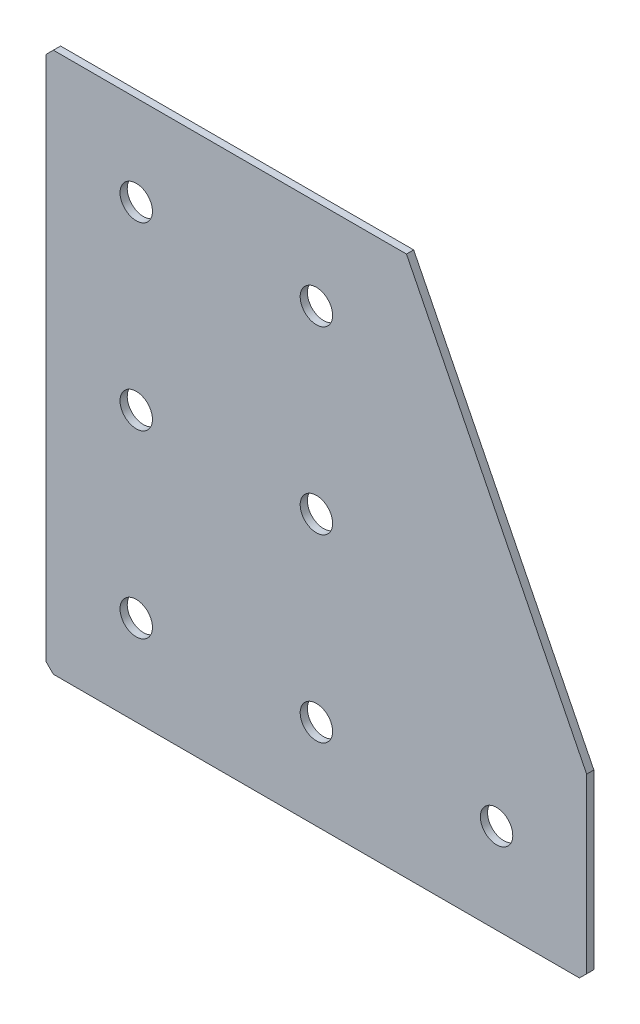
ISO-10303-21;
HEADER;
FILE_DESCRIPTION(('STEP AP214'),'2;1');
FILE_NAME('part.step','',(''),(''),'','','');
FILE_SCHEMA(('AUTOMOTIVE_DESIGN { 1 0 10303 214 1 1 1 1 }'));
ENDSEC;
DATA;
#1=APPLICATION_CONTEXT('core data for automotive mechanical design processes');
#2=APPLICATION_PROTOCOL_DEFINITION('international standard','automotive_design',2000,#1);
#3=PRODUCT_CONTEXT('',#1,'mechanical');
#4=PRODUCT('Part','Part','',(#3));
#5=PRODUCT_RELATED_PRODUCT_CATEGORY('part','',(#4));
#6=PRODUCT_DEFINITION_FORMATION('','',#4);
#7=PRODUCT_DEFINITION_CONTEXT('part definition',#1,'design');
#8=PRODUCT_DEFINITION('design','',#6,#7);
#9=PRODUCT_DEFINITION_SHAPE('','',#8);
#10=(LENGTH_UNIT() NAMED_UNIT(*) SI_UNIT(.MILLI.,.METRE.));
#11=(NAMED_UNIT(*) PLANE_ANGLE_UNIT() SI_UNIT($,.RADIAN.));
#12=(NAMED_UNIT(*) SI_UNIT($,.STERADIAN.) SOLID_ANGLE_UNIT());
#13=UNCERTAINTY_MEASURE_WITH_UNIT(LENGTH_MEASURE(1.E-05),#10,'distance_accuracy_value','');
#14=(GEOMETRIC_REPRESENTATION_CONTEXT(3) GLOBAL_UNCERTAINTY_ASSIGNED_CONTEXT((#13)) GLOBAL_UNIT_ASSIGNED_CONTEXT((#10,
#11,#12)) REPRESENTATION_CONTEXT('',''));
#15=CARTESIAN_POINT('',(0.,0.,0.));
#16=DIRECTION('',(0.,0.,1.));
#17=DIRECTION('',(1.,0.,0.));
#18=AXIS2_PLACEMENT_3D('',#15,#16,#17);
#19=CARTESIAN_POINT('',(100.,0.,-2.));
#20=DIRECTION('',(0.,-1.,0.));
#21=DIRECTION('',(1.,0.,0.));
#22=AXIS2_PLACEMENT_3D('',#19,#20,#21);
#23=PLANE('',#22);
#24=DIRECTION('',(1.,0.,0.));
#25=VECTOR('',#24,1.);
#26=CARTESIAN_POINT('',(100.,0.,-2.));
#27=LINE('',#26,#25);
#28=CARTESIAN_POINT('',(2.,0.,-2.));
#29=VERTEX_POINT('',#28);
#30=CARTESIAN_POINT('',(100.,0.,-2.));
#31=VERTEX_POINT('',#30);
#32=EDGE_CURVE('E104',#29,#31,#27,.T.);
#33=ORIENTED_EDGE('',*,*,#32,.F.);
#34=DIRECTION('',(0.,0.,1.));
#35=VECTOR('',#34,1.);
#36=CARTESIAN_POINT('',(2.,0.,-2.));
#37=LINE('',#36,#35);
#38=CARTESIAN_POINT('',(2.,0.,0.));
#39=VERTEX_POINT('',#38);
#40=EDGE_CURVE('E133',#29,#39,#37,.T.);
#41=ORIENTED_EDGE('',*,*,#40,.T.);
#42=DIRECTION('',(1.,0.,0.));
#43=VECTOR('',#42,1.);
#44=CARTESIAN_POINT('',(100.,0.,0.));
#45=LINE('',#44,#43);
#46=CARTESIAN_POINT('',(100.,0.,0.));
#47=VERTEX_POINT('',#46);
#48=EDGE_CURVE('E130',#39,#47,#45,.T.);
#49=ORIENTED_EDGE('',*,*,#48,.T.);
#50=DIRECTION('',(0.,0.,1.));
#51=VECTOR('',#50,1.);
#52=CARTESIAN_POINT('',(100.,0.,-2.));
#53=LINE('',#52,#51);
#54=EDGE_CURVE('E122',#31,#47,#53,.T.);
#55=ORIENTED_EDGE('',*,*,#54,.F.);
#56=EDGE_LOOP('',(#33,#41,#49,#55));
#57=FACE_BOUND('',#56,.T.);
#58=ADVANCED_FACE('F39',(#57),#23,.F.);
#59=CARTESIAN_POINT('',(150.,-100.,-2.));
#60=DIRECTION('',(-0.894427190999916,-0.447213595499958,0.));
#61=DIRECTION('',(0.447213595499958,-0.894427190999916,0.));
#62=AXIS2_PLACEMENT_3D('',#59,#60,#61);
#63=PLANE('',#62);
#64=DIRECTION('',(0.447213595499958,-0.894427190999916,0.));
#65=VECTOR('',#64,1.);
#66=CARTESIAN_POINT('',(150.,-100.,0.));
#67=LINE('',#66,#65);
#68=CARTESIAN_POINT('',(150.,-100.,0.));
#69=VERTEX_POINT('',#68);
#70=EDGE_CURVE('E185',#47,#69,#67,.T.);
#71=ORIENTED_EDGE('',*,*,#70,.T.);
#72=DIRECTION('',(0.,0.,1.));
#73=VECTOR('',#72,1.);
#74=CARTESIAN_POINT('',(150.,-100.,-2.));
#75=LINE('',#74,#73);
#76=CARTESIAN_POINT('',(150.,-100.,-2.));
#77=VERTEX_POINT('',#76);
#78=EDGE_CURVE('E124',#77,#69,#75,.T.);
#79=ORIENTED_EDGE('',*,*,#78,.F.);
#80=DIRECTION('',(0.447213595499958,-0.894427190999916,0.));
#81=VECTOR('',#80,1.);
#82=CARTESIAN_POINT('',(150.,-100.,-2.));
#83=LINE('',#82,#81);
#84=EDGE_CURVE('E108',#31,#77,#83,.T.);
#85=ORIENTED_EDGE('',*,*,#84,.F.);
#86=ORIENTED_EDGE('',*,*,#54,.T.);
#87=EDGE_LOOP('',(#71,#79,#85,#86));
#88=FACE_BOUND('',#87,.T.);
#89=ADVANCED_FACE('F121',(#88),#63,.F.);
#90=CARTESIAN_POINT('',(150.,-150.,-2.));
#91=DIRECTION('',(-1.,0.,0.));
#92=DIRECTION('',(0.,-1.,0.));
#93=AXIS2_PLACEMENT_3D('',#90,#91,#92);
#94=PLANE('',#93);
#95=DIRECTION('',(0.,-1.,0.));
#96=VECTOR('',#95,1.);
#97=CARTESIAN_POINT('',(150.,-150.,0.));
#98=LINE('',#97,#96);
#99=CARTESIAN_POINT('',(150.,-148.,0.));
#100=VERTEX_POINT('',#99);
#101=EDGE_CURVE('E180',#69,#100,#98,.T.);
#102=ORIENTED_EDGE('',*,*,#101,.T.);
#103=DIRECTION('',(0.,0.,-1.));
#104=VECTOR('',#103,1.);
#105=CARTESIAN_POINT('',(150.,-148.,-2.));
#106=LINE('',#105,#104);
#107=CARTESIAN_POINT('',(150.,-148.,-2.));
#108=VERTEX_POINT('',#107);
#109=EDGE_CURVE('E11',#100,#108,#106,.T.);
#110=ORIENTED_EDGE('',*,*,#109,.T.);
#111=DIRECTION('',(0.,-1.,0.));
#112=VECTOR('',#111,1.);
#113=CARTESIAN_POINT('',(150.,-150.,-2.));
#114=LINE('',#113,#112);
#115=EDGE_CURVE('E127',#77,#108,#114,.T.);
#116=ORIENTED_EDGE('',*,*,#115,.F.);
#117=ORIENTED_EDGE('',*,*,#78,.T.);
#118=EDGE_LOOP('',(#102,#110,#116,#117));
#119=FACE_BOUND('',#118,.T.);
#120=ADVANCED_FACE('F293',(#119),#94,.F.);
#121=CARTESIAN_POINT('',(0.,-150.,-2.));
#122=DIRECTION('',(0.,1.,0.));
#123=DIRECTION('',(0.,0.,1.));
#124=AXIS2_PLACEMENT_3D('',#121,#122,#123);
#125=PLANE('',#124);
#126=DIRECTION('',(-1.,0.,0.));
#127=VECTOR('',#126,1.);
#128=CARTESIAN_POINT('',(0.,-150.,-2.));
#129=LINE('',#128,#127);
#130=CARTESIAN_POINT('',(148.,-150.,-2.));
#131=VERTEX_POINT('',#130);
#132=CARTESIAN_POINT('',(2.,-150.,-2.));
#133=VERTEX_POINT('',#132);
#134=EDGE_CURVE('E172',#131,#133,#129,.T.);
#135=ORIENTED_EDGE('',*,*,#134,.F.);
#136=DIRECTION('',(0.,0.,1.));
#137=VECTOR('',#136,1.);
#138=CARTESIAN_POINT('',(148.,-150.,-2.));
#139=LINE('',#138,#137);
#140=CARTESIAN_POINT('',(148.,-150.,0.));
#141=VERTEX_POINT('',#140);
#142=EDGE_CURVE('E48',#131,#141,#139,.T.);
#143=ORIENTED_EDGE('',*,*,#142,.T.);
#144=DIRECTION('',(-1.,0.,0.));
#145=VECTOR('',#144,1.);
#146=CARTESIAN_POINT('',(0.,-150.,0.));
#147=LINE('',#146,#145);
#148=CARTESIAN_POINT('',(2.,-150.,0.));
#149=VERTEX_POINT('',#148);
#150=EDGE_CURVE('E171',#141,#149,#147,.T.);
#151=ORIENTED_EDGE('',*,*,#150,.T.);
#152=DIRECTION('',(0.,0.,-1.));
#153=VECTOR('',#152,1.);
#154=CARTESIAN_POINT('',(2.,-150.,-2.));
#155=LINE('',#154,#153);
#156=EDGE_CURVE('E55',#149,#133,#155,.T.);
#157=ORIENTED_EDGE('',*,*,#156,.T.);
#158=EDGE_LOOP('',(#135,#143,#151,#157));
#159=FACE_BOUND('',#158,.T.);
#160=ADVANCED_FACE('F170',(#159),#125,.F.);
#161=CARTESIAN_POINT('',(0.,0.,-2.));
#162=DIRECTION('',(1.,0.,0.));
#163=DIRECTION('',(0.,0.,-1.));
#164=AXIS2_PLACEMENT_3D('',#161,#162,#163);
#165=PLANE('',#164);
#166=DIRECTION('',(0.,1.,0.));
#167=VECTOR('',#166,1.);
#168=CARTESIAN_POINT('',(0.,0.,0.));
#169=LINE('',#168,#167);
#170=CARTESIAN_POINT('',(0.,-148.,0.));
#171=VERTEX_POINT('',#170);
#172=CARTESIAN_POINT('',(0.,-2.00000000000003,0.));
#173=VERTEX_POINT('',#172);
#174=EDGE_CURVE('E117',#171,#173,#169,.T.);
#175=ORIENTED_EDGE('',*,*,#174,.T.);
#176=DIRECTION('',(0.,0.,-1.));
#177=VECTOR('',#176,1.);
#178=CARTESIAN_POINT('',(0.,-2.00000000000003,-2.));
#179=LINE('',#178,#177);
#180=CARTESIAN_POINT('',(0.,-2.00000000000003,-2.));
#181=VERTEX_POINT('',#180);
#182=EDGE_CURVE('E155',#173,#181,#179,.T.);
#183=ORIENTED_EDGE('',*,*,#182,.T.);
#184=DIRECTION('',(0.,1.,0.));
#185=VECTOR('',#184,1.);
#186=CARTESIAN_POINT('',(0.,0.,-2.));
#187=LINE('',#186,#185);
#188=CARTESIAN_POINT('',(0.,-148.,-2.));
#189=VERTEX_POINT('',#188);
#190=EDGE_CURVE('E139',#189,#181,#187,.T.);
#191=ORIENTED_EDGE('',*,*,#190,.F.);
#192=DIRECTION('',(0.,0.,1.));
#193=VECTOR('',#192,1.);
#194=CARTESIAN_POINT('',(0.,-148.,-2.));
#195=LINE('',#194,#193);
#196=EDGE_CURVE('E151',#189,#171,#195,.T.);
#197=ORIENTED_EDGE('',*,*,#196,.T.);
#198=EDGE_LOOP('',(#175,#183,#191,#197));
#199=FACE_BOUND('',#198,.T.);
#200=ADVANCED_FACE('F259',(#199),#165,.F.);
#201=CARTESIAN_POINT('',(0.,0.,-2.));
#202=DIRECTION('',(0.,0.,1.));
#203=DIRECTION('',(1.,0.,0.));
#204=AXIS2_PLACEMENT_3D('',#201,#202,#203);
#205=PLANE('',#204);
#206=CARTESIAN_POINT('',(75.,-125.,-2.00000000000001));
#207=DIRECTION('',(0.,0.,-1.));
#208=DIRECTION('',(0.,1.,0.));
#209=AXIS2_PLACEMENT_3D('',#206,#207,#208);
#210=CIRCLE('',#209,4.5);
#211=CARTESIAN_POINT('',(75.,-120.5,-2.00000000000001));
#212=VERTEX_POINT('',#211);
#213=EDGE_CURVE('E250',#212,#212,#210,.T.);
#214=ORIENTED_EDGE('',*,*,#213,.F.);
#215=EDGE_LOOP('',(#214));
#216=FACE_BOUND('',#215,.T.);
#217=CARTESIAN_POINT('',(25.,-125.,-2.00000000000001));
#218=DIRECTION('',(0.,0.,-1.));
#219=DIRECTION('',(0.,1.,0.));
#220=AXIS2_PLACEMENT_3D('',#217,#218,#219);
#221=CIRCLE('',#220,4.5);
#222=CARTESIAN_POINT('',(25.,-120.5,-2.00000000000001));
#223=VERTEX_POINT('',#222);
#224=EDGE_CURVE('E242',#223,#223,#221,.T.);
#225=ORIENTED_EDGE('',*,*,#224,.F.);
#226=EDGE_LOOP('',(#225));
#227=FACE_BOUND('',#226,.T.);
#228=CARTESIAN_POINT('',(25.,-75.,-2.));
#229=DIRECTION('',(0.,0.,-1.));
#230=DIRECTION('',(0.,1.,0.));
#231=AXIS2_PLACEMENT_3D('',#228,#229,#230);
#232=CIRCLE('',#231,4.5);
#233=CARTESIAN_POINT('',(25.,-70.5,-2.));
#234=VERTEX_POINT('',#233);
#235=EDGE_CURVE('E234',#234,#234,#232,.T.);
#236=ORIENTED_EDGE('',*,*,#235,.F.);
#237=EDGE_LOOP('',(#236));
#238=FACE_BOUND('',#237,.T.);
#239=CARTESIAN_POINT('',(25.,-25.,-2.));
#240=DIRECTION('',(0.,0.,-1.));
#241=DIRECTION('',(0.,1.,0.));
#242=AXIS2_PLACEMENT_3D('',#239,#240,#241);
#243=CIRCLE('',#242,4.5);
#244=CARTESIAN_POINT('',(25.,-20.5,-2.));
#245=VERTEX_POINT('',#244);
#246=EDGE_CURVE('E226',#245,#245,#243,.T.);
#247=ORIENTED_EDGE('',*,*,#246,.F.);
#248=EDGE_LOOP('',(#247));
#249=FACE_BOUND('',#248,.T.);
#250=CARTESIAN_POINT('',(125.,-125.,-2.00000000000001));
#251=DIRECTION('',(0.,0.,-1.));
#252=DIRECTION('',(0.,1.,0.));
#253=AXIS2_PLACEMENT_3D('',#250,#251,#252);
#254=CIRCLE('',#253,4.5);
#255=CARTESIAN_POINT('',(125.,-120.5,-2.00000000000001));
#256=VERTEX_POINT('',#255);
#257=EDGE_CURVE('E218',#256,#256,#254,.T.);
#258=ORIENTED_EDGE('',*,*,#257,.F.);
#259=EDGE_LOOP('',(#258));
#260=FACE_BOUND('',#259,.T.);
#261=CARTESIAN_POINT('',(75.,-75.,-2.));
#262=DIRECTION('',(0.,0.,-1.));
#263=DIRECTION('',(0.,1.,0.));
#264=AXIS2_PLACEMENT_3D('',#261,#262,#263);
#265=CIRCLE('',#264,4.5);
#266=CARTESIAN_POINT('',(75.,-70.5,-2.));
#267=VERTEX_POINT('',#266);
#268=EDGE_CURVE('E210',#267,#267,#265,.T.);
#269=ORIENTED_EDGE('',*,*,#268,.F.);
#270=EDGE_LOOP('',(#269));
#271=FACE_BOUND('',#270,.T.);
#272=CARTESIAN_POINT('',(75.,-25.,-2.));
#273=DIRECTION('',(0.,0.,-1.));
#274=DIRECTION('',(0.,1.,0.));
#275=AXIS2_PLACEMENT_3D('',#272,#273,#274);
#276=CIRCLE('',#275,4.5);
#277=CARTESIAN_POINT('',(75.,-20.5,-2.));
#278=VERTEX_POINT('',#277);
#279=EDGE_CURVE('E202',#278,#278,#276,.T.);
#280=ORIENTED_EDGE('',*,*,#279,.F.);
#281=EDGE_LOOP('',(#280));
#282=FACE_BOUND('',#281,.T.);
#283=ORIENTED_EDGE('',*,*,#190,.T.);
#284=DIRECTION('',(-0.707106781186543,-0.707106781186552,0.));
#285=VECTOR('',#284,1.);
#286=CARTESIAN_POINT('',(2.,0.,-2.));
#287=LINE('',#286,#285);
#288=EDGE_CURVE('E111',#181,#29,#287,.F.);
#289=ORIENTED_EDGE('',*,*,#288,.T.);
#290=ORIENTED_EDGE('',*,*,#32,.T.);
#291=ORIENTED_EDGE('',*,*,#84,.T.);
#292=ORIENTED_EDGE('',*,*,#115,.T.);
#293=DIRECTION('',(0.707106781186548,0.707106781186548,0.));
#294=VECTOR('',#293,1.);
#295=CARTESIAN_POINT('',(148.,-150.,-2.));
#296=LINE('',#295,#294);
#297=EDGE_CURVE('E62',#108,#131,#296,.F.);
#298=ORIENTED_EDGE('',*,*,#297,.T.);
#299=ORIENTED_EDGE('',*,*,#134,.T.);
#300=DIRECTION('',(0.707106781186548,-0.707106781186548,0.));
#301=VECTOR('',#300,1.);
#302=CARTESIAN_POINT('',(0.,-148.,-2.));
#303=LINE('',#302,#301);
#304=EDGE_CURVE('E158',#133,#189,#303,.F.);
#305=ORIENTED_EDGE('',*,*,#304,.T.);
#306=EDGE_LOOP('',(#283,#289,#290,#291,#292,#298,#299,#305));
#307=FACE_BOUND('',#306,.T.);
#308=ADVANCED_FACE('F107',(#216,#227,#238,#249,#260,#271,#282,#307),#205,.F.);
#309=CARTESIAN_POINT('',(0.,0.,0.));
#310=DIRECTION('',(0.,0.,1.));
#311=DIRECTION('',(1.,0.,0.));
#312=AXIS2_PLACEMENT_3D('',#309,#310,#311);
#313=PLANE('',#312);
#314=CARTESIAN_POINT('',(75.,-125.,0.));
#315=DIRECTION('',(0.,0.,-1.));
#316=DIRECTION('',(0.,1.,0.));
#317=AXIS2_PLACEMENT_3D('',#314,#315,#316);
#318=CIRCLE('',#317,4.5);
#319=CARTESIAN_POINT('',(75.,-120.5,0.));
#320=VERTEX_POINT('',#319);
#321=EDGE_CURVE('E246',#320,#320,#318,.T.);
#322=ORIENTED_EDGE('',*,*,#321,.T.);
#323=EDGE_LOOP('',(#322));
#324=FACE_BOUND('',#323,.T.);
#325=CARTESIAN_POINT('',(25.,-125.,0.));
#326=DIRECTION('',(0.,0.,-1.));
#327=DIRECTION('',(0.,1.,0.));
#328=AXIS2_PLACEMENT_3D('',#325,#326,#327);
#329=CIRCLE('',#328,4.5);
#330=CARTESIAN_POINT('',(25.,-120.5,0.));
#331=VERTEX_POINT('',#330);
#332=EDGE_CURVE('E238',#331,#331,#329,.T.);
#333=ORIENTED_EDGE('',*,*,#332,.T.);
#334=EDGE_LOOP('',(#333));
#335=FACE_BOUND('',#334,.T.);
#336=CARTESIAN_POINT('',(25.,-75.,0.));
#337=DIRECTION('',(0.,0.,-1.));
#338=DIRECTION('',(0.,1.,0.));
#339=AXIS2_PLACEMENT_3D('',#336,#337,#338);
#340=CIRCLE('',#339,4.5);
#341=CARTESIAN_POINT('',(25.,-70.5,0.));
#342=VERTEX_POINT('',#341);
#343=EDGE_CURVE('E230',#342,#342,#340,.T.);
#344=ORIENTED_EDGE('',*,*,#343,.T.);
#345=EDGE_LOOP('',(#344));
#346=FACE_BOUND('',#345,.T.);
#347=CARTESIAN_POINT('',(25.,-25.,0.));
#348=DIRECTION('',(0.,0.,-1.));
#349=DIRECTION('',(0.,1.,0.));
#350=AXIS2_PLACEMENT_3D('',#347,#348,#349);
#351=CIRCLE('',#350,4.5);
#352=CARTESIAN_POINT('',(25.,-20.5,0.));
#353=VERTEX_POINT('',#352);
#354=EDGE_CURVE('E222',#353,#353,#351,.T.);
#355=ORIENTED_EDGE('',*,*,#354,.T.);
#356=EDGE_LOOP('',(#355));
#357=FACE_BOUND('',#356,.T.);
#358=CARTESIAN_POINT('',(125.,-125.,0.));
#359=DIRECTION('',(0.,0.,-1.));
#360=DIRECTION('',(0.,1.,0.));
#361=AXIS2_PLACEMENT_3D('',#358,#359,#360);
#362=CIRCLE('',#361,4.5);
#363=CARTESIAN_POINT('',(125.,-120.5,0.));
#364=VERTEX_POINT('',#363);
#365=EDGE_CURVE('E214',#364,#364,#362,.T.);
#366=ORIENTED_EDGE('',*,*,#365,.T.);
#367=EDGE_LOOP('',(#366));
#368=FACE_BOUND('',#367,.T.);
#369=CARTESIAN_POINT('',(75.,-75.,0.));
#370=DIRECTION('',(0.,0.,-1.));
#371=DIRECTION('',(0.,1.,0.));
#372=AXIS2_PLACEMENT_3D('',#369,#370,#371);
#373=CIRCLE('',#372,4.5);
#374=CARTESIAN_POINT('',(75.,-70.5,0.));
#375=VERTEX_POINT('',#374);
#376=EDGE_CURVE('E206',#375,#375,#373,.T.);
#377=ORIENTED_EDGE('',*,*,#376,.T.);
#378=EDGE_LOOP('',(#377));
#379=FACE_BOUND('',#378,.T.);
#380=CARTESIAN_POINT('',(75.,-25.,0.));
#381=DIRECTION('',(0.,0.,-1.));
#382=DIRECTION('',(0.,1.,0.));
#383=AXIS2_PLACEMENT_3D('',#380,#381,#382);
#384=CIRCLE('',#383,4.5);
#385=CARTESIAN_POINT('',(75.,-20.5,0.));
#386=VERTEX_POINT('',#385);
#387=EDGE_CURVE('E192',#386,#386,#384,.T.);
#388=ORIENTED_EDGE('',*,*,#387,.T.);
#389=EDGE_LOOP('',(#388));
#390=FACE_BOUND('',#389,.T.);
#391=ORIENTED_EDGE('',*,*,#48,.F.);
#392=DIRECTION('',(0.707106781186543,0.707106781186552,0.));
#393=VECTOR('',#392,1.);
#394=CARTESIAN_POINT('',(1.00000000000001,-1.,0.));
#395=LINE('',#394,#393);
#396=EDGE_CURVE('E148',#39,#173,#395,.F.);
#397=ORIENTED_EDGE('',*,*,#396,.T.);
#398=ORIENTED_EDGE('',*,*,#174,.F.);
#399=DIRECTION('',(-0.707106781186548,0.707106781186548,0.));
#400=VECTOR('',#399,1.);
#401=CARTESIAN_POINT('',(-74.,-74.,0.));
#402=LINE('',#401,#400);
#403=EDGE_CURVE('E137',#171,#149,#402,.F.);
#404=ORIENTED_EDGE('',*,*,#403,.T.);
#405=ORIENTED_EDGE('',*,*,#150,.F.);
#406=DIRECTION('',(-0.707106781186548,-0.707106781186548,0.));
#407=VECTOR('',#406,1.);
#408=CARTESIAN_POINT('',(149.,-149.,0.));
#409=LINE('',#408,#407);
#410=EDGE_CURVE('E145',#141,#100,#409,.F.);
#411=ORIENTED_EDGE('',*,*,#410,.T.);
#412=ORIENTED_EDGE('',*,*,#101,.F.);
#413=ORIENTED_EDGE('',*,*,#70,.F.);
#414=EDGE_LOOP('',(#391,#397,#398,#404,#405,#411,#412,#413));
#415=FACE_BOUND('',#414,.T.);
#416=ADVANCED_FACE('F175',(#324,#335,#346,#357,#368,#379,#390,#415),#313,.T.);
#417=CARTESIAN_POINT('',(75.,-25.,-2.));
#418=DIRECTION('',(0.,0.,-1.));
#419=DIRECTION('',(0.,1.,0.));
#420=AXIS2_PLACEMENT_3D('',#417,#418,#419);
#421=CYLINDRICAL_SURFACE('',#420,4.5);
#422=ORIENTED_EDGE('',*,*,#387,.F.);
#423=EDGE_LOOP('',(#422));
#424=FACE_BOUND('',#423,.T.);
#425=ORIENTED_EDGE('',*,*,#279,.T.);
#426=EDGE_LOOP('',(#425));
#427=FACE_BOUND('',#426,.T.);
#428=ADVANCED_FACE('F273',(#424,#427),#421,.F.);
#429=CARTESIAN_POINT('',(75.,-75.,-2.));
#430=DIRECTION('',(0.,0.,-1.));
#431=DIRECTION('',(0.,1.,0.));
#432=AXIS2_PLACEMENT_3D('',#429,#430,#431);
#433=CYLINDRICAL_SURFACE('',#432,4.5);
#434=ORIENTED_EDGE('',*,*,#376,.F.);
#435=EDGE_LOOP('',(#434));
#436=FACE_BOUND('',#435,.T.);
#437=ORIENTED_EDGE('',*,*,#268,.T.);
#438=EDGE_LOOP('',(#437));
#439=FACE_BOUND('',#438,.T.);
#440=ADVANCED_FACE('F275',(#436,#439),#433,.F.);
#441=CARTESIAN_POINT('',(125.,-125.,-2.00000000000001));
#442=DIRECTION('',(0.,0.,-1.));
#443=DIRECTION('',(0.,1.,0.));
#444=AXIS2_PLACEMENT_3D('',#441,#442,#443);
#445=CYLINDRICAL_SURFACE('',#444,4.5);
#446=ORIENTED_EDGE('',*,*,#365,.F.);
#447=EDGE_LOOP('',(#446));
#448=FACE_BOUND('',#447,.T.);
#449=ORIENTED_EDGE('',*,*,#257,.T.);
#450=EDGE_LOOP('',(#449));
#451=FACE_BOUND('',#450,.T.);
#452=ADVANCED_FACE('F282',(#448,#451),#445,.F.);
#453=CARTESIAN_POINT('',(25.,-25.,-2.));
#454=DIRECTION('',(0.,0.,-1.));
#455=DIRECTION('',(0.,1.,0.));
#456=AXIS2_PLACEMENT_3D('',#453,#454,#455);
#457=CYLINDRICAL_SURFACE('',#456,4.5);
#458=ORIENTED_EDGE('',*,*,#354,.F.);
#459=EDGE_LOOP('',(#458));
#460=FACE_BOUND('',#459,.T.);
#461=ORIENTED_EDGE('',*,*,#246,.T.);
#462=EDGE_LOOP('',(#461));
#463=FACE_BOUND('',#462,.T.);
#464=ADVANCED_FACE('F385',(#460,#463),#457,.F.);
#465=CARTESIAN_POINT('',(25.,-75.,-2.));
#466=DIRECTION('',(0.,0.,-1.));
#467=DIRECTION('',(0.,1.,0.));
#468=AXIS2_PLACEMENT_3D('',#465,#466,#467);
#469=CYLINDRICAL_SURFACE('',#468,4.5);
#470=ORIENTED_EDGE('',*,*,#343,.F.);
#471=EDGE_LOOP('',(#470));
#472=FACE_BOUND('',#471,.T.);
#473=ORIENTED_EDGE('',*,*,#235,.T.);
#474=EDGE_LOOP('',(#473));
#475=FACE_BOUND('',#474,.T.);
#476=ADVANCED_FACE('F377',(#472,#475),#469,.F.);
#477=CARTESIAN_POINT('',(25.,-125.,-2.00000000000001));
#478=DIRECTION('',(0.,0.,-1.));
#479=DIRECTION('',(0.,1.,0.));
#480=AXIS2_PLACEMENT_3D('',#477,#478,#479);
#481=CYLINDRICAL_SURFACE('',#480,4.5);
#482=ORIENTED_EDGE('',*,*,#332,.F.);
#483=EDGE_LOOP('',(#482));
#484=FACE_BOUND('',#483,.T.);
#485=ORIENTED_EDGE('',*,*,#224,.T.);
#486=EDGE_LOOP('',(#485));
#487=FACE_BOUND('',#486,.T.);
#488=ADVANCED_FACE('F370',(#484,#487),#481,.F.);
#489=CARTESIAN_POINT('',(75.,-125.,-2.00000000000001));
#490=DIRECTION('',(0.,0.,-1.));
#491=DIRECTION('',(0.,1.,0.));
#492=AXIS2_PLACEMENT_3D('',#489,#490,#491);
#493=CYLINDRICAL_SURFACE('',#492,4.5);
#494=ORIENTED_EDGE('',*,*,#321,.F.);
#495=EDGE_LOOP('',(#494));
#496=FACE_BOUND('',#495,.T.);
#497=ORIENTED_EDGE('',*,*,#213,.T.);
#498=EDGE_LOOP('',(#497));
#499=FACE_BOUND('',#498,.T.);
#500=ADVANCED_FACE('F255',(#496,#499),#493,.F.);
#501=CARTESIAN_POINT('',(2.,0.,-2.));
#502=DIRECTION('',(0.707106781186552,-0.707106781186542,0.));
#503=DIRECTION('',(0.,0.,1.));
#504=AXIS2_PLACEMENT_3D('',#501,#502,#503);
#505=PLANE('',#504);
#506=ORIENTED_EDGE('',*,*,#288,.F.);
#507=ORIENTED_EDGE('',*,*,#182,.F.);
#508=ORIENTED_EDGE('',*,*,#396,.F.);
#509=ORIENTED_EDGE('',*,*,#40,.F.);
#510=EDGE_LOOP('',(#506,#507,#508,#509));
#511=FACE_BOUND('',#510,.T.);
#512=ADVANCED_FACE('F297',(#511),#505,.F.);
#513=CARTESIAN_POINT('',(148.,-150.,-2.));
#514=DIRECTION('',(-0.707106781186547,0.707106781186547,0.));
#515=DIRECTION('',(0.,0.,1.));
#516=AXIS2_PLACEMENT_3D('',#513,#514,#515);
#517=PLANE('',#516);
#518=ORIENTED_EDGE('',*,*,#297,.F.);
#519=ORIENTED_EDGE('',*,*,#109,.F.);
#520=ORIENTED_EDGE('',*,*,#410,.F.);
#521=ORIENTED_EDGE('',*,*,#142,.F.);
#522=EDGE_LOOP('',(#518,#519,#520,#521));
#523=FACE_BOUND('',#522,.T.);
#524=ADVANCED_FACE('F299',(#523),#517,.F.);
#525=CARTESIAN_POINT('',(0.,-148.,-2.));
#526=DIRECTION('',(0.707106781186547,0.707106781186547,0.));
#527=DIRECTION('',(0.,0.,1.));
#528=AXIS2_PLACEMENT_3D('',#525,#526,#527);
#529=PLANE('',#528);
#530=ORIENTED_EDGE('',*,*,#304,.F.);
#531=ORIENTED_EDGE('',*,*,#156,.F.);
#532=ORIENTED_EDGE('',*,*,#403,.F.);
#533=ORIENTED_EDGE('',*,*,#196,.F.);
#534=EDGE_LOOP('',(#530,#531,#532,#533));
#535=FACE_BOUND('',#534,.T.);
#536=ADVANCED_FACE('F41',(#535),#529,.F.);
#537=CLOSED_SHELL('',(#58,#89,#120,#160,#200,#308,#416,#428,#440,#452,#464,#476,#488,#500,#512,
#524,#536));
#538=MANIFOLD_SOLID_BREP('B2',#537);
#539=ADVANCED_BREP_SHAPE_REPRESENTATION('',(#18,#538),#14);
#540=SHAPE_DEFINITION_REPRESENTATION(#9,#539);
ENDSEC;
END-ISO-10303-21;
